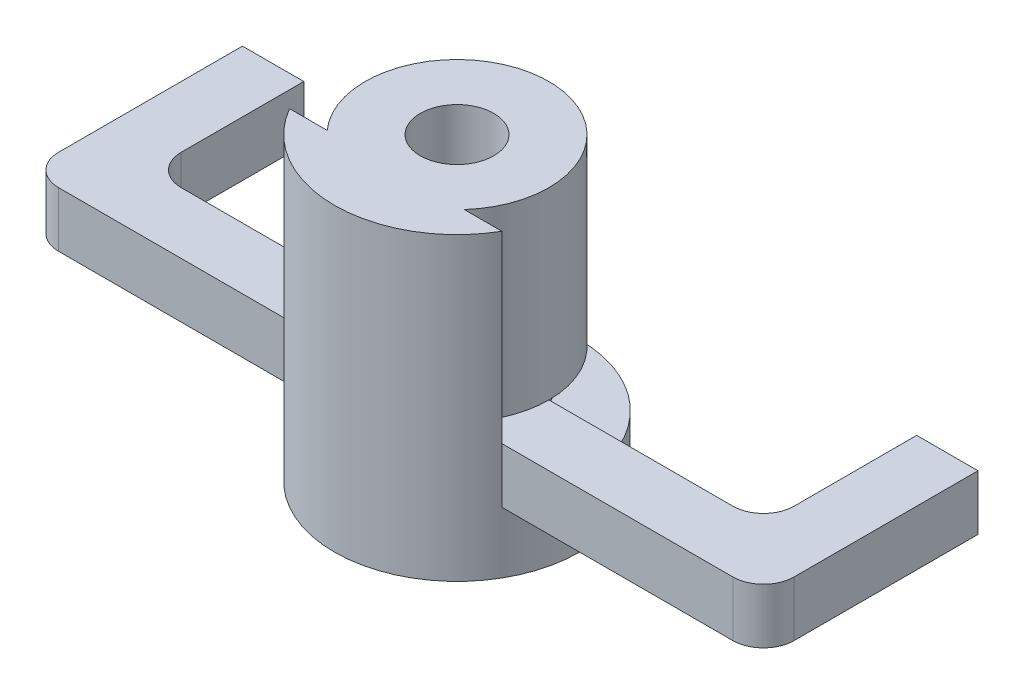
ISO-10303-21;
HEADER;
FILE_DESCRIPTION(('STEP AP214'),'2;1');
FILE_NAME('part.step','',(''),(''),'','','');
FILE_SCHEMA(('AUTOMOTIVE_DESIGN { 1 0 10303 214 1 1 1 1 }'));
ENDSEC;
DATA;
#1=APPLICATION_CONTEXT('core data for automotive mechanical design processes');
#2=APPLICATION_PROTOCOL_DEFINITION('international standard','automotive_design',2000,#1);
#3=PRODUCT_CONTEXT('',#1,'mechanical');
#4=PRODUCT('Part','Part','',(#3));
#5=PRODUCT_RELATED_PRODUCT_CATEGORY('part','',(#4));
#6=PRODUCT_DEFINITION_FORMATION('','',#4);
#7=PRODUCT_DEFINITION_CONTEXT('part definition',#1,'design');
#8=PRODUCT_DEFINITION('design','',#6,#7);
#9=PRODUCT_DEFINITION_SHAPE('','',#8);
#10=(LENGTH_UNIT() NAMED_UNIT(*) SI_UNIT(.MILLI.,.METRE.));
#11=(NAMED_UNIT(*) PLANE_ANGLE_UNIT() SI_UNIT($,.RADIAN.));
#12=(NAMED_UNIT(*) SI_UNIT($,.STERADIAN.) SOLID_ANGLE_UNIT());
#13=UNCERTAINTY_MEASURE_WITH_UNIT(LENGTH_MEASURE(1.E-05),#10,'distance_accuracy_value','');
#14=(GEOMETRIC_REPRESENTATION_CONTEXT(3) GLOBAL_UNCERTAINTY_ASSIGNED_CONTEXT((#13)) GLOBAL_UNIT_ASSIGNED_CONTEXT((#10,
#11,#12)) REPRESENTATION_CONTEXT('',''));
#15=CARTESIAN_POINT('',(0.,0.,0.));
#16=DIRECTION('',(0.,0.,1.));
#17=DIRECTION('',(1.,0.,0.));
#18=AXIS2_PLACEMENT_3D('',#15,#16,#17);
#19=CARTESIAN_POINT('',(0.,1.8,5.));
#20=DIRECTION('',(0.,1.,0.));
#21=DIRECTION('',(0.,0.,1.));
#22=AXIS2_PLACEMENT_3D('',#19,#20,#21);
#23=PLANE('',#22);
#24=DIRECTION('',(1.,0.,0.));
#25=VECTOR('',#24,1.);
#26=CARTESIAN_POINT('',(-12.,1.8,7.));
#27=LINE('',#26,#25);
#28=CARTESIAN_POINT('',(-11.,1.8,7.));
#29=VERTEX_POINT('',#28);
#30=CARTESIAN_POINT('',(-3.46410161513775,1.8,7.));
#31=VERTEX_POINT('',#30);
#32=EDGE_CURVE('E363',#29,#31,#27,.T.);
#33=ORIENTED_EDGE('',*,*,#32,.T.);
#34=DIRECTION('',(-1.,0.,0.));
#35=VECTOR('',#34,1.);
#36=CARTESIAN_POINT('',(-3.46410161513775,1.8,7.));
#37=LINE('',#36,#35);
#38=CARTESIAN_POINT('',(-2.23606797749979,1.8,7.));
#39=VERTEX_POINT('',#38);
#40=EDGE_CURVE('E260',#39,#31,#37,.T.);
#41=ORIENTED_EDGE('',*,*,#40,.F.);
#42=CARTESIAN_POINT('',(0.,1.8,5.));
#43=DIRECTION('',(0.,1.,0.));
#44=DIRECTION('',(0.,0.,1.));
#45=AXIS2_PLACEMENT_3D('',#42,#43,#44);
#46=CIRCLE('',#45,3.);
#47=CARTESIAN_POINT('',(-3.,1.8,5.));
#48=VERTEX_POINT('',#47);
#49=EDGE_CURVE('E289',#48,#39,#46,.T.);
#50=ORIENTED_EDGE('',*,*,#49,.F.);
#51=DIRECTION('',(-1.,0.,0.));
#52=VECTOR('',#51,1.);
#53=CARTESIAN_POINT('',(-2.,1.8,5.));
#54=LINE('',#53,#52);
#55=CARTESIAN_POINT('',(-9.,1.8,5.));
#56=VERTEX_POINT('',#55);
#57=EDGE_CURVE('E388',#48,#56,#54,.T.);
#58=ORIENTED_EDGE('',*,*,#57,.T.);
#59=CARTESIAN_POINT('',(-9.,1.8,4.));
#60=DIRECTION('',(0.,1.,0.));
#61=DIRECTION('',(0.,0.,1.));
#62=AXIS2_PLACEMENT_3D('',#59,#60,#61);
#63=CIRCLE('',#62,1.);
#64=CARTESIAN_POINT('',(-10.,1.8,4.));
#65=VERTEX_POINT('',#64);
#66=EDGE_CURVE('E469',#56,#65,#63,.F.);
#67=ORIENTED_EDGE('',*,*,#66,.T.);
#68=DIRECTION('',(0.,0.,-1.));
#69=VECTOR('',#68,1.);
#70=CARTESIAN_POINT('',(-10.,1.8,0.));
#71=LINE('',#70,#69);
#72=CARTESIAN_POINT('',(-10.,1.8,0.));
#73=VERTEX_POINT('',#72);
#74=EDGE_CURVE('E355',#65,#73,#71,.T.);
#75=ORIENTED_EDGE('',*,*,#74,.T.);
#76=DIRECTION('',(-1.,0.,0.));
#77=VECTOR('',#76,1.);
#78=CARTESIAN_POINT('',(-10.,1.8,0.));
#79=LINE('',#78,#77);
#80=CARTESIAN_POINT('',(-12.,1.8,0.));
#81=VERTEX_POINT('',#80);
#82=EDGE_CURVE('E357',#73,#81,#79,.T.);
#83=ORIENTED_EDGE('',*,*,#82,.T.);
#84=DIRECTION('',(0.,0.,1.));
#85=VECTOR('',#84,1.);
#86=CARTESIAN_POINT('',(-12.,1.8,0.));
#87=LINE('',#86,#85);
#88=CARTESIAN_POINT('',(-12.,1.8,6.));
#89=VERTEX_POINT('',#88);
#90=EDGE_CURVE('E360',#81,#89,#87,.T.);
#91=ORIENTED_EDGE('',*,*,#90,.T.);
#92=CARTESIAN_POINT('',(-11.,1.8,6.));
#93=DIRECTION('',(0.,1.,0.));
#94=DIRECTION('',(0.,0.,1.));
#95=AXIS2_PLACEMENT_3D('',#92,#93,#94);
#96=CIRCLE('',#95,1.);
#97=EDGE_CURVE('E444',#89,#29,#96,.T.);
#98=ORIENTED_EDGE('',*,*,#97,.T.);
#99=EDGE_LOOP('',(#33,#41,#50,#58,#67,#75,#83,#91,#98));
#100=FACE_BOUND('',#99,.T.);
#101=ADVANCED_FACE('F35',(#100),#23,.T.);
#102=CARTESIAN_POINT('',(2.23606797749979,1.8,7.));
#103=VERTEX_POINT('',#102);
#104=CARTESIAN_POINT('',(3.,1.8,5.));
#105=VERTEX_POINT('',#104);
#106=EDGE_CURVE('E288',#103,#105,#46,.T.);
#107=ORIENTED_EDGE('',*,*,#106,.F.);
#108=CARTESIAN_POINT('',(3.46410161513775,1.8,7.));
#109=VERTEX_POINT('',#108);
#110=EDGE_CURVE('E277',#109,#103,#37,.T.);
#111=ORIENTED_EDGE('',*,*,#110,.F.);
#112=DIRECTION('',(1.,0.,0.));
#113=VECTOR('',#112,1.);
#114=CARTESIAN_POINT('',(3.46410161513775,1.8,7.));
#115=LINE('',#114,#113);
#116=CARTESIAN_POINT('',(11.,1.8,7.));
#117=VERTEX_POINT('',#116);
#118=EDGE_CURVE('E366',#109,#117,#115,.T.);
#119=ORIENTED_EDGE('',*,*,#118,.T.);
#120=CARTESIAN_POINT('',(11.,1.8,6.));
#121=DIRECTION('',(0.,1.,0.));
#122=DIRECTION('',(0.,0.,1.));
#123=AXIS2_PLACEMENT_3D('',#120,#121,#122);
#124=CIRCLE('',#123,1.);
#125=CARTESIAN_POINT('',(12.,1.8,6.));
#126=VERTEX_POINT('',#125);
#127=EDGE_CURVE('E442',#117,#126,#124,.T.);
#128=ORIENTED_EDGE('',*,*,#127,.T.);
#129=DIRECTION('',(0.,0.,-1.));
#130=VECTOR('',#129,1.);
#131=CARTESIAN_POINT('',(12.,1.8,7.));
#132=LINE('',#131,#130);
#133=CARTESIAN_POINT('',(12.,1.8,0.));
#134=VERTEX_POINT('',#133);
#135=EDGE_CURVE('E369',#126,#134,#132,.T.);
#136=ORIENTED_EDGE('',*,*,#135,.T.);
#137=DIRECTION('',(-1.,0.,0.));
#138=VECTOR('',#137,1.);
#139=CARTESIAN_POINT('',(12.,1.8,0.));
#140=LINE('',#139,#138);
#141=CARTESIAN_POINT('',(10.,1.8,0.));
#142=VERTEX_POINT('',#141);
#143=EDGE_CURVE('E371',#134,#142,#140,.T.);
#144=ORIENTED_EDGE('',*,*,#143,.T.);
#145=DIRECTION('',(0.,0.,1.));
#146=VECTOR('',#145,1.);
#147=CARTESIAN_POINT('',(10.,1.8,0.));
#148=LINE('',#147,#146);
#149=CARTESIAN_POINT('',(10.,1.8,4.));
#150=VERTEX_POINT('',#149);
#151=EDGE_CURVE('E373',#142,#150,#148,.T.);
#152=ORIENTED_EDGE('',*,*,#151,.T.);
#153=CARTESIAN_POINT('',(9.,1.8,4.));
#154=DIRECTION('',(0.,1.,0.));
#155=DIRECTION('',(0.,0.,1.));
#156=AXIS2_PLACEMENT_3D('',#153,#154,#155);
#157=CIRCLE('',#156,1.);
#158=CARTESIAN_POINT('',(9.,1.8,5.));
#159=VERTEX_POINT('',#158);
#160=EDGE_CURVE('E464',#150,#159,#157,.F.);
#161=ORIENTED_EDGE('',*,*,#160,.T.);
#162=DIRECTION('',(-1.,0.,0.));
#163=VECTOR('',#162,1.);
#164=CARTESIAN_POINT('',(2.,1.8,5.));
#165=LINE('',#164,#163);
#166=EDGE_CURVE('E377',#159,#105,#165,.T.);
#167=ORIENTED_EDGE('',*,*,#166,.T.);
#168=EDGE_LOOP('',(#107,#111,#119,#128,#136,#144,#152,#161,#167));
#169=FACE_BOUND('',#168,.T.);
#170=ADVANCED_FACE('F497',(#169),#23,.T.);
#171=CARTESIAN_POINT('',(0.,7.8,5.));
#172=DIRECTION('',(0.,-1.,0.));
#173=DIRECTION('',(0.,0.,-1.));
#174=AXIS2_PLACEMENT_3D('',#171,#172,#173);
#175=CYLINDRICAL_SURFACE('',#174,3.);
#176=DIRECTION('',(0.,-1.,0.));
#177=VECTOR('',#176,1.);
#178=CARTESIAN_POINT('',(-2.23606797749979,7.8,7.));
#179=LINE('',#178,#177);
#180=CARTESIAN_POINT('',(-2.23606797749979,7.8,7.));
#181=VERTEX_POINT('',#180);
#182=EDGE_CURVE('E11',#181,#39,#179,.T.);
#183=ORIENTED_EDGE('',*,*,#182,.F.);
#184=CARTESIAN_POINT('',(0.,7.8,5.));
#185=DIRECTION('',(0.,1.,0.));
#186=DIRECTION('',(0.,0.,1.));
#187=AXIS2_PLACEMENT_3D('',#184,#185,#186);
#188=CIRCLE('',#187,3.);
#189=CARTESIAN_POINT('',(2.23606797749979,7.8,7.));
#190=VERTEX_POINT('',#189);
#191=EDGE_CURVE('E283',#190,#181,#188,.T.);
#192=ORIENTED_EDGE('',*,*,#191,.F.);
#193=DIRECTION('',(0.,-1.,0.));
#194=VECTOR('',#193,1.);
#195=CARTESIAN_POINT('',(2.23606797749979,7.8,7.));
#196=LINE('',#195,#194);
#197=EDGE_CURVE('E43',#103,#190,#196,.F.);
#198=ORIENTED_EDGE('',*,*,#197,.F.);
#199=ORIENTED_EDGE('',*,*,#106,.T.);
#200=EDGE_CURVE('E281',#105,#48,#46,.T.);
#201=ORIENTED_EDGE('',*,*,#200,.T.);
#202=ORIENTED_EDGE('',*,*,#49,.T.);
#203=EDGE_LOOP('',(#183,#192,#198,#199,#201,#202));
#204=FACE_BOUND('',#203,.T.);
#205=ADVANCED_FACE('F492',(#204),#175,.T.);
#206=CARTESIAN_POINT('',(0.,1.8,5.));
#207=DIRECTION('',(0.,-1.,0.));
#208=DIRECTION('',(0.,0.,-1.));
#209=AXIS2_PLACEMENT_3D('',#206,#207,#208);
#210=CYLINDRICAL_SURFACE('',#209,2.);
#211=CARTESIAN_POINT('',(0.,0.,5.));
#212=DIRECTION('',(0.,-1.,0.));
#213=DIRECTION('',(0.,0.,1.));
#214=AXIS2_PLACEMENT_3D('',#211,#212,#213);
#215=CIRCLE('',#214,2.);
#216=CARTESIAN_POINT('',(0.180277563773204,0.,6.99185842870421));
#217=VERTEX_POINT('',#216);
#218=CARTESIAN_POINT('',(-0.180277563773204,0.,6.99185842870421));
#219=VERTEX_POINT('',#218);
#220=EDGE_CURVE('E415',#217,#219,#215,.T.);
#221=ORIENTED_EDGE('',*,*,#220,.T.);
#222=DIRECTION('',(0.,-1.,0.));
#223=VECTOR('',#222,1.);
#224=CARTESIAN_POINT('',(-0.180277563773204,1.8,6.99185842870421));
#225=LINE('',#224,#223);
#226=CARTESIAN_POINT('',(-0.180277563773204,1.8,6.99185842870421));
#227=VERTEX_POINT('',#226);
#228=EDGE_CURVE('E342',#219,#227,#225,.F.);
#229=ORIENTED_EDGE('',*,*,#228,.T.);
#230=CARTESIAN_POINT('',(0.,1.8,5.));
#231=DIRECTION('',(0.,-1.,0.));
#232=DIRECTION('',(0.,0.,1.));
#233=AXIS2_PLACEMENT_3D('',#230,#231,#232);
#234=CIRCLE('',#233,2.);
#235=CARTESIAN_POINT('',(0.,1.8,7.));
#236=VERTEX_POINT('',#235);
#237=EDGE_CURVE('E50',#236,#227,#234,.T.);
#238=ORIENTED_EDGE('',*,*,#237,.F.);
#239=CARTESIAN_POINT('',(0.180277563773204,1.8,6.99185842870421));
#240=VERTEX_POINT('',#239);
#241=EDGE_CURVE('E520',#240,#236,#234,.T.);
#242=ORIENTED_EDGE('',*,*,#241,.F.);
#243=DIRECTION('',(0.,-1.,0.));
#244=VECTOR('',#243,1.);
#245=CARTESIAN_POINT('',(0.180277563773204,1.8,6.99185842870421));
#246=LINE('',#245,#244);
#247=EDGE_CURVE('E339',#240,#217,#246,.T.);
#248=ORIENTED_EDGE('',*,*,#247,.T.);
#249=EDGE_LOOP('',(#221,#229,#238,#242,#248));
#250=FACE_BOUND('',#249,.T.);
#251=ADVANCED_FACE('F531',(#250),#210,.F.);
#252=CARTESIAN_POINT('',(1.8151387818866,0.,5.83980426439214));
#253=VERTEX_POINT('',#252);
#254=CARTESIAN_POINT('',(1.6348612181134,0.,6.15205416431206));
#255=VERTEX_POINT('',#254);
#256=EDGE_CURVE('E416',#253,#255,#215,.T.);
#257=ORIENTED_EDGE('',*,*,#256,.T.);
#258=DIRECTION('',(0.,-1.,0.));
#259=VECTOR('',#258,1.);
#260=CARTESIAN_POINT('',(1.6348612181134,1.8,6.15205416431206));
#261=LINE('',#260,#259);
#262=CARTESIAN_POINT('',(1.6348612181134,1.8,6.15205416431206));
#263=VERTEX_POINT('',#262);
#264=EDGE_CURVE('E333',#255,#263,#261,.F.);
#265=ORIENTED_EDGE('',*,*,#264,.T.);
#266=CARTESIAN_POINT('',(1.8151387818866,1.8,5.83980426439214));
#267=VERTEX_POINT('',#266);
#268=EDGE_CURVE('E383',#267,#263,#234,.T.);
#269=ORIENTED_EDGE('',*,*,#268,.F.);
#270=DIRECTION('',(0.,-1.,0.));
#271=VECTOR('',#270,1.);
#272=CARTESIAN_POINT('',(1.8151387818866,1.8,5.83980426439214));
#273=LINE('',#272,#271);
#274=EDGE_CURVE('E330',#267,#253,#273,.T.);
#275=ORIENTED_EDGE('',*,*,#274,.T.);
#276=EDGE_LOOP('',(#257,#265,#269,#275));
#277=FACE_BOUND('',#276,.T.);
#278=ADVANCED_FACE('F623',(#277),#210,.F.);
#279=CARTESIAN_POINT('',(0.,0.,5.));
#280=DIRECTION('',(0.,-1.,0.));
#281=DIRECTION('',(0.,0.,-1.));
#282=AXIS2_PLACEMENT_3D('',#279,#280,#281);
#283=PLANE('',#282);
#284=ORIENTED_EDGE('',*,*,#220,.F.);
#285=DIRECTION('',(-1.,0.,0.));
#286=VECTOR('',#285,1.);
#287=CARTESIAN_POINT('',(0.,0.,6.99185842870421));
#288=LINE('',#287,#286);
#289=EDGE_CURVE('E486',#217,#219,#288,.T.);
#290=ORIENTED_EDGE('',*,*,#289,.T.);
#291=EDGE_LOOP('',(#284,#290));
#292=FACE_BOUND('',#291,.T.);
#293=ADVANCED_FACE('F628',(#292),#283,.F.);
#294=ORIENTED_EDGE('',*,*,#256,.F.);
#295=DIRECTION('',(-0.5,0.,0.866025403784439));
#296=VECTOR('',#295,1.);
#297=CARTESIAN_POINT('',(1.725,0.,5.9959292143521));
#298=LINE('',#297,#296);
#299=EDGE_CURVE('E483',#253,#255,#298,.T.);
#300=ORIENTED_EDGE('',*,*,#299,.T.);
#301=EDGE_LOOP('',(#294,#300));
#302=FACE_BOUND('',#301,.T.);
#303=ADVANCED_FACE('F632',(#302),#283,.F.);
#304=DIRECTION('',(1.,0.,0.));
#305=VECTOR('',#304,1.);
#306=CARTESIAN_POINT('',(0.,0.,3.00814157129579));
#307=LINE('',#306,#305);
#308=CARTESIAN_POINT('',(-1.15,0.,3.00814157129579));
#309=VERTEX_POINT('',#308);
#310=CARTESIAN_POINT('',(1.15,0.,3.00814157129579));
#311=VERTEX_POINT('',#310);
#312=EDGE_CURVE('E477',#309,#311,#307,.T.);
#313=ORIENTED_EDGE('',*,*,#312,.T.);
#314=DIRECTION('',(0.5,0.,0.866025403784438));
#315=VECTOR('',#314,1.);
#316=CARTESIAN_POINT('',(1.725,0.,4.00407078564789));
#317=LINE('',#316,#315);
#318=CARTESIAN_POINT('',(2.3,0.,5.));
#319=VERTEX_POINT('',#318);
#320=EDGE_CURVE('E480',#311,#319,#317,.T.);
#321=ORIENTED_EDGE('',*,*,#320,.T.);
#322=DIRECTION('',(-1.,0.,0.));
#323=VECTOR('',#322,1.);
#324=CARTESIAN_POINT('',(2.,0.,5.));
#325=LINE('',#324,#323);
#326=CARTESIAN_POINT('',(4.,0.,5.));
#327=VERTEX_POINT('',#326);
#328=EDGE_CURVE('E408',#327,#319,#325,.T.);
#329=ORIENTED_EDGE('',*,*,#328,.F.);
#330=CARTESIAN_POINT('',(0.,0.,5.));
#331=DIRECTION('',(0.,-1.,0.));
#332=DIRECTION('',(0.,0.,-1.));
#333=AXIS2_PLACEMENT_3D('',#330,#331,#332);
#334=CIRCLE('',#333,4.);
#335=CARTESIAN_POINT('',(-4.,0.,5.));
#336=VERTEX_POINT('',#335);
#337=EDGE_CURVE('E353',#336,#327,#334,.T.);
#338=ORIENTED_EDGE('',*,*,#337,.F.);
#339=DIRECTION('',(-1.,0.,0.));
#340=VECTOR('',#339,1.);
#341=CARTESIAN_POINT('',(-2.,0.,5.));
#342=LINE('',#341,#340);
#343=CARTESIAN_POINT('',(-2.3,0.,5.));
#344=VERTEX_POINT('',#343);
#345=EDGE_CURVE('E358',#344,#336,#342,.T.);
#346=ORIENTED_EDGE('',*,*,#345,.F.);
#347=DIRECTION('',(0.5,0.,-0.866025403784439));
#348=VECTOR('',#347,1.);
#349=CARTESIAN_POINT('',(-1.725,0.,4.0040707856479));
#350=LINE('',#349,#348);
#351=EDGE_CURVE('E474',#344,#309,#350,.T.);
#352=ORIENTED_EDGE('',*,*,#351,.T.);
#353=EDGE_LOOP('',(#313,#321,#329,#338,#346,#352));
#354=FACE_BOUND('',#353,.T.);
#355=ADVANCED_FACE('F570',(#354),#283,.F.);
#356=CARTESIAN_POINT('',(0.,0.,5.));
#357=DIRECTION('',(0.,1.,0.));
#358=DIRECTION('',(0.,0.,1.));
#359=AXIS2_PLACEMENT_3D('',#356,#357,#358);
#360=PLANE('',#359);
#361=CARTESIAN_POINT('',(3.46410161513775,0.,7.));
#362=VERTEX_POINT('',#361);
#363=EDGE_CURVE('E351',#327,#362,#334,.T.);
#364=ORIENTED_EDGE('',*,*,#363,.F.);
#365=CARTESIAN_POINT('',(9.,0.,5.));
#366=VERTEX_POINT('',#365);
#367=EDGE_CURVE('E409',#366,#327,#325,.T.);
#368=ORIENTED_EDGE('',*,*,#367,.F.);
#369=CARTESIAN_POINT('',(9.,0.,4.));
#370=DIRECTION('',(0.,1.,0.));
#371=DIRECTION('',(0.,0.,1.));
#372=AXIS2_PLACEMENT_3D('',#369,#370,#371);
#373=CIRCLE('',#372,1.);
#374=CARTESIAN_POINT('',(10.,0.,4.));
#375=VERTEX_POINT('',#374);
#376=EDGE_CURVE('E462',#366,#375,#373,.T.);
#377=ORIENTED_EDGE('',*,*,#376,.T.);
#378=DIRECTION('',(0.,0.,1.));
#379=VECTOR('',#378,1.);
#380=CARTESIAN_POINT('',(10.,0.,0.));
#381=LINE('',#380,#379);
#382=CARTESIAN_POINT('',(10.,0.,0.));
#383=VERTEX_POINT('',#382);
#384=EDGE_CURVE('E405',#383,#375,#381,.T.);
#385=ORIENTED_EDGE('',*,*,#384,.F.);
#386=DIRECTION('',(-1.,0.,0.));
#387=VECTOR('',#386,1.);
#388=CARTESIAN_POINT('',(12.,0.,0.));
#389=LINE('',#388,#387);
#390=CARTESIAN_POINT('',(12.,0.,0.));
#391=VERTEX_POINT('',#390);
#392=EDGE_CURVE('E403',#391,#383,#389,.T.);
#393=ORIENTED_EDGE('',*,*,#392,.F.);
#394=DIRECTION('',(0.,0.,-1.));
#395=VECTOR('',#394,1.);
#396=CARTESIAN_POINT('',(12.,0.,7.));
#397=LINE('',#396,#395);
#398=CARTESIAN_POINT('',(12.,0.,6.));
#399=VERTEX_POINT('',#398);
#400=EDGE_CURVE('E401',#399,#391,#397,.T.);
#401=ORIENTED_EDGE('',*,*,#400,.F.);
#402=CARTESIAN_POINT('',(11.,0.,6.));
#403=DIRECTION('',(0.,1.,0.));
#404=DIRECTION('',(0.,0.,1.));
#405=AXIS2_PLACEMENT_3D('',#402,#403,#404);
#406=CIRCLE('',#405,1.);
#407=CARTESIAN_POINT('',(11.,0.,7.));
#408=VERTEX_POINT('',#407);
#409=EDGE_CURVE('E436',#399,#408,#406,.F.);
#410=ORIENTED_EDGE('',*,*,#409,.T.);
#411=DIRECTION('',(1.,0.,0.));
#412=VECTOR('',#411,1.);
#413=CARTESIAN_POINT('',(3.46410161513775,0.,7.));
#414=LINE('',#413,#412);
#415=EDGE_CURVE('E398',#362,#408,#414,.T.);
#416=ORIENTED_EDGE('',*,*,#415,.F.);
#417=EDGE_LOOP('',(#364,#368,#377,#385,#393,#401,#410,#416));
#418=FACE_BOUND('',#417,.T.);
#419=ADVANCED_FACE('F573',(#418),#360,.F.);
#420=CARTESIAN_POINT('',(-10.,1.8,0.));
#421=DIRECTION('',(-1.,0.,0.));
#422=DIRECTION('',(0.,0.,1.));
#423=AXIS2_PLACEMENT_3D('',#420,#421,#422);
#424=PLANE('',#423);
#425=ORIENTED_EDGE('',*,*,#74,.F.);
#426=DIRECTION('',(0.,-1.,0.));
#427=VECTOR('',#426,1.);
#428=CARTESIAN_POINT('',(-10.,0.,4.));
#429=LINE('',#428,#427);
#430=CARTESIAN_POINT('',(-10.,0.,4.));
#431=VERTEX_POINT('',#430);
#432=EDGE_CURVE('E456',#65,#431,#429,.T.);
#433=ORIENTED_EDGE('',*,*,#432,.T.);
#434=DIRECTION('',(0.,0.,-1.));
#435=VECTOR('',#434,1.);
#436=CARTESIAN_POINT('',(-10.,0.,0.));
#437=LINE('',#436,#435);
#438=CARTESIAN_POINT('',(-10.,0.,0.));
#439=VERTEX_POINT('',#438);
#440=EDGE_CURVE('E350',#431,#439,#437,.T.);
#441=ORIENTED_EDGE('',*,*,#440,.T.);
#442=DIRECTION('',(0.,-1.,0.));
#443=VECTOR('',#442,1.);
#444=CARTESIAN_POINT('',(-10.,1.8,0.));
#445=LINE('',#444,#443);
#446=EDGE_CURVE('E430',#73,#439,#445,.T.);
#447=ORIENTED_EDGE('',*,*,#446,.F.);
#448=EDGE_LOOP('',(#425,#433,#441,#447));
#449=FACE_BOUND('',#448,.T.);
#450=ADVANCED_FACE('F549',(#449),#424,.F.);
#451=CARTESIAN_POINT('',(-10.,1.8,0.));
#452=DIRECTION('',(0.,0.,1.));
#453=DIRECTION('',(1.,0.,0.));
#454=AXIS2_PLACEMENT_3D('',#451,#452,#453);
#455=PLANE('',#454);
#456=DIRECTION('',(-1.,0.,0.));
#457=VECTOR('',#456,1.);
#458=CARTESIAN_POINT('',(-10.,0.,0.));
#459=LINE('',#458,#457);
#460=CARTESIAN_POINT('',(-12.,0.,0.));
#461=VERTEX_POINT('',#460);
#462=EDGE_CURVE('E390',#439,#461,#459,.T.);
#463=ORIENTED_EDGE('',*,*,#462,.T.);
#464=DIRECTION('',(0.,-1.,0.));
#465=VECTOR('',#464,1.);
#466=CARTESIAN_POINT('',(-12.,1.8,0.));
#467=LINE('',#466,#465);
#468=EDGE_CURVE('E427',#81,#461,#467,.T.);
#469=ORIENTED_EDGE('',*,*,#468,.F.);
#470=ORIENTED_EDGE('',*,*,#82,.F.);
#471=ORIENTED_EDGE('',*,*,#446,.T.);
#472=EDGE_LOOP('',(#463,#469,#470,#471));
#473=FACE_BOUND('',#472,.T.);
#474=ADVANCED_FACE('F551',(#473),#455,.F.);
#475=CARTESIAN_POINT('',(-12.,1.8,0.));
#476=DIRECTION('',(1.,0.,0.));
#477=DIRECTION('',(0.,0.,-1.));
#478=AXIS2_PLACEMENT_3D('',#475,#476,#477);
#479=PLANE('',#478);
#480=DIRECTION('',(0.,0.,1.));
#481=VECTOR('',#480,1.);
#482=CARTESIAN_POINT('',(-12.,0.,0.));
#483=LINE('',#482,#481);
#484=CARTESIAN_POINT('',(-12.,0.,6.));
#485=VERTEX_POINT('',#484);
#486=EDGE_CURVE('E392',#461,#485,#483,.T.);
#487=ORIENTED_EDGE('',*,*,#486,.T.);
#488=DIRECTION('',(0.,-1.,0.));
#489=VECTOR('',#488,1.);
#490=CARTESIAN_POINT('',(-12.,1.8,6.));
#491=LINE('',#490,#489);
#492=EDGE_CURVE('E440',#485,#89,#491,.F.);
#493=ORIENTED_EDGE('',*,*,#492,.T.);
#494=ORIENTED_EDGE('',*,*,#90,.F.);
#495=ORIENTED_EDGE('',*,*,#468,.T.);
#496=EDGE_LOOP('',(#487,#493,#494,#495));
#497=FACE_BOUND('',#496,.T.);
#498=ADVANCED_FACE('F661',(#497),#479,.F.);
#499=CARTESIAN_POINT('',(-12.,1.8,7.));
#500=DIRECTION('',(0.,0.,-1.));
#501=DIRECTION('',(-1.,0.,0.));
#502=AXIS2_PLACEMENT_3D('',#499,#500,#501);
#503=PLANE('',#502);
#504=ORIENTED_EDGE('',*,*,#32,.F.);
#505=DIRECTION('',(0.,-1.,0.));
#506=VECTOR('',#505,1.);
#507=CARTESIAN_POINT('',(-11.,1.8,7.));
#508=LINE('',#507,#506);
#509=CARTESIAN_POINT('',(-11.,0.,7.));
#510=VERTEX_POINT('',#509);
#511=EDGE_CURVE('E433',#29,#510,#508,.T.);
#512=ORIENTED_EDGE('',*,*,#511,.T.);
#513=DIRECTION('',(1.,0.,0.));
#514=VECTOR('',#513,1.);
#515=CARTESIAN_POINT('',(-12.,0.,7.));
#516=LINE('',#515,#514);
#517=CARTESIAN_POINT('',(-3.46410161513775,0.,7.));
#518=VERTEX_POINT('',#517);
#519=EDGE_CURVE('E395',#510,#518,#516,.T.);
#520=ORIENTED_EDGE('',*,*,#519,.T.);
#521=DIRECTION('',(0.,-1.,0.));
#522=VECTOR('',#521,1.);
#523=CARTESIAN_POINT('',(-3.46410161513775,1.8,7.));
#524=LINE('',#523,#522);
#525=EDGE_CURVE('E425',#31,#518,#524,.T.);
#526=ORIENTED_EDGE('',*,*,#525,.F.);
#527=EDGE_LOOP('',(#504,#512,#520,#526));
#528=FACE_BOUND('',#527,.T.);
#529=ADVANCED_FACE('F563',(#528),#503,.F.);
#530=CARTESIAN_POINT('',(0.,1.8,5.));
#531=DIRECTION('',(0.,-1.,0.));
#532=DIRECTION('',(0.,0.,-1.));
#533=AXIS2_PLACEMENT_3D('',#530,#531,#532);
#534=CYLINDRICAL_SURFACE('',#533,4.);
#535=ORIENTED_EDGE('',*,*,#525,.T.);
#536=EDGE_CURVE('E354',#518,#336,#334,.T.);
#537=ORIENTED_EDGE('',*,*,#536,.T.);
#538=ORIENTED_EDGE('',*,*,#337,.T.);
#539=ORIENTED_EDGE('',*,*,#363,.T.);
#540=DIRECTION('',(0.,-1.,0.));
#541=VECTOR('',#540,1.);
#542=CARTESIAN_POINT('',(3.46410161513775,1.8,7.));
#543=LINE('',#542,#541);
#544=EDGE_CURVE('E256',#109,#362,#543,.T.);
#545=ORIENTED_EDGE('',*,*,#544,.F.);
#546=DIRECTION('',(0.,-1.,0.));
#547=VECTOR('',#546,1.);
#548=CARTESIAN_POINT('',(3.46410161513775,15.011102550928,7.));
#549=LINE('',#548,#547);
#550=CARTESIAN_POINT('',(3.46410161513775,7.8,7.));
#551=VERTEX_POINT('',#550);
#552=EDGE_CURVE('E249',#551,#109,#549,.T.);
#553=ORIENTED_EDGE('',*,*,#552,.F.);
#554=CARTESIAN_POINT('',(0.,7.8,5.));
#555=DIRECTION('',(0.,1.,0.));
#556=DIRECTION('',(0.,0.,1.));
#557=AXIS2_PLACEMENT_3D('',#554,#555,#556);
#558=CIRCLE('',#557,4.);
#559=CARTESIAN_POINT('',(-3.46410161513775,7.8,7.));
#560=VERTEX_POINT('',#559);
#561=EDGE_CURVE('E254',#560,#551,#558,.T.);
#562=ORIENTED_EDGE('',*,*,#561,.F.);
#563=DIRECTION('',(0.,-1.,0.));
#564=VECTOR('',#563,1.);
#565=CARTESIAN_POINT('',(-3.46410161513775,15.011102550928,7.));
#566=LINE('',#565,#564);
#567=EDGE_CURVE('E261',#560,#31,#566,.T.);
#568=ORIENTED_EDGE('',*,*,#567,.T.);
#569=EDGE_LOOP('',(#535,#537,#538,#539,#545,#553,#562,#568));
#570=FACE_BOUND('',#569,.T.);
#571=CARTESIAN_POINT('',(0.,-2.,5.));
#572=DIRECTION('',(0.,-1.,0.));
#573=DIRECTION('',(0.,0.,-1.));
#574=AXIS2_PLACEMENT_3D('',#571,#572,#573);
#575=CIRCLE('',#574,4.);
#576=CARTESIAN_POINT('',(0.,-2.,0.999999999999999));
#577=VERTEX_POINT('',#576);
#578=EDGE_CURVE('E347',#577,#577,#575,.T.);
#579=ORIENTED_EDGE('',*,*,#578,.F.);
#580=EDGE_LOOP('',(#579));
#581=FACE_BOUND('',#580,.T.);
#582=ADVANCED_FACE('F251',(#570,#581),#534,.T.);
#583=CARTESIAN_POINT('',(3.46410161513775,1.8,7.));
#584=DIRECTION('',(0.,0.,-1.));
#585=DIRECTION('',(-1.,0.,0.));
#586=AXIS2_PLACEMENT_3D('',#583,#584,#585);
#587=PLANE('',#586);
#588=ORIENTED_EDGE('',*,*,#415,.T.);
#589=DIRECTION('',(0.,-1.,0.));
#590=VECTOR('',#589,1.);
#591=CARTESIAN_POINT('',(11.,1.8,7.));
#592=LINE('',#591,#590);
#593=EDGE_CURVE('E449',#408,#117,#592,.F.);
#594=ORIENTED_EDGE('',*,*,#593,.T.);
#595=ORIENTED_EDGE('',*,*,#118,.F.);
#596=ORIENTED_EDGE('',*,*,#544,.T.);
#597=EDGE_LOOP('',(#588,#594,#595,#596));
#598=FACE_BOUND('',#597,.T.);
#599=ADVANCED_FACE('F579',(#598),#587,.F.);
#600=CARTESIAN_POINT('',(12.,1.8,7.));
#601=DIRECTION('',(-1.,0.,0.));
#602=DIRECTION('',(0.,0.,1.));
#603=AXIS2_PLACEMENT_3D('',#600,#601,#602);
#604=PLANE('',#603);
#605=ORIENTED_EDGE('',*,*,#135,.F.);
#606=DIRECTION('',(0.,-1.,0.));
#607=VECTOR('',#606,1.);
#608=CARTESIAN_POINT('',(12.,1.8,6.));
#609=LINE('',#608,#607);
#610=EDGE_CURVE('E446',#126,#399,#609,.T.);
#611=ORIENTED_EDGE('',*,*,#610,.T.);
#612=ORIENTED_EDGE('',*,*,#400,.T.);
#613=DIRECTION('',(0.,-1.,0.));
#614=VECTOR('',#613,1.);
#615=CARTESIAN_POINT('',(12.,1.8,0.));
#616=LINE('',#615,#614);
#617=EDGE_CURVE('E421',#134,#391,#616,.T.);
#618=ORIENTED_EDGE('',*,*,#617,.F.);
#619=EDGE_LOOP('',(#605,#611,#612,#618));
#620=FACE_BOUND('',#619,.T.);
#621=ADVANCED_FACE('F587',(#620),#604,.F.);
#622=CARTESIAN_POINT('',(12.,1.8,0.));
#623=DIRECTION('',(0.,0.,1.));
#624=DIRECTION('',(1.,0.,0.));
#625=AXIS2_PLACEMENT_3D('',#622,#623,#624);
#626=PLANE('',#625);
#627=ORIENTED_EDGE('',*,*,#392,.T.);
#628=DIRECTION('',(0.,-1.,0.));
#629=VECTOR('',#628,1.);
#630=CARTESIAN_POINT('',(10.,1.8,0.));
#631=LINE('',#630,#629);
#632=EDGE_CURVE('E387',#142,#383,#631,.T.);
#633=ORIENTED_EDGE('',*,*,#632,.F.);
#634=ORIENTED_EDGE('',*,*,#143,.F.);
#635=ORIENTED_EDGE('',*,*,#617,.T.);
#636=EDGE_LOOP('',(#627,#633,#634,#635));
#637=FACE_BOUND('',#636,.T.);
#638=ADVANCED_FACE('F592',(#637),#626,.F.);
#639=CARTESIAN_POINT('',(10.,1.8,0.));
#640=DIRECTION('',(1.,0.,0.));
#641=DIRECTION('',(0.,0.,-1.));
#642=AXIS2_PLACEMENT_3D('',#639,#640,#641);
#643=PLANE('',#642);
#644=ORIENTED_EDGE('',*,*,#384,.T.);
#645=DIRECTION('',(0.,-1.,0.));
#646=VECTOR('',#645,1.);
#647=CARTESIAN_POINT('',(10.,1.8,4.));
#648=LINE('',#647,#646);
#649=EDGE_CURVE('E454',#375,#150,#648,.F.);
#650=ORIENTED_EDGE('',*,*,#649,.T.);
#651=ORIENTED_EDGE('',*,*,#151,.F.);
#652=ORIENTED_EDGE('',*,*,#632,.T.);
#653=EDGE_LOOP('',(#644,#650,#651,#652));
#654=FACE_BOUND('',#653,.T.);
#655=ADVANCED_FACE('F598',(#654),#643,.F.);
#656=CARTESIAN_POINT('',(2.,1.8,5.));
#657=DIRECTION('',(0.,0.,1.));
#658=DIRECTION('',(1.,0.,0.));
#659=AXIS2_PLACEMENT_3D('',#656,#657,#658);
#660=PLANE('',#659);
#661=ORIENTED_EDGE('',*,*,#328,.T.);
#662=DIRECTION('',(0.,-1.,0.));
#663=VECTOR('',#662,1.);
#664=CARTESIAN_POINT('',(2.3,9.,5.));
#665=LINE('',#664,#663);
#666=CARTESIAN_POINT('',(2.3,1.8,5.));
#667=VERTEX_POINT('',#666);
#668=EDGE_CURVE('E310',#667,#319,#665,.T.);
#669=ORIENTED_EDGE('',*,*,#668,.F.);
#670=EDGE_CURVE('E376',#105,#667,#165,.T.);
#671=ORIENTED_EDGE('',*,*,#670,.F.);
#672=ORIENTED_EDGE('',*,*,#166,.F.);
#673=DIRECTION('',(0.,-1.,0.));
#674=VECTOR('',#673,1.);
#675=CARTESIAN_POINT('',(9.,0.,5.));
#676=LINE('',#675,#674);
#677=EDGE_CURVE('E451',#159,#366,#676,.T.);
#678=ORIENTED_EDGE('',*,*,#677,.T.);
#679=ORIENTED_EDGE('',*,*,#367,.T.);
#680=EDGE_LOOP('',(#661,#669,#671,#672,#678,#679));
#681=FACE_BOUND('',#680,.T.);
#682=ADVANCED_FACE('F504',(#681),#660,.F.);
#683=CARTESIAN_POINT('',(-1.63486121811339,0.,6.15205416431208));
#684=VERTEX_POINT('',#683);
#685=CARTESIAN_POINT('',(-1.81513878188661,0.,5.83980426439213));
#686=VERTEX_POINT('',#685);
#687=EDGE_CURVE('E412',#684,#686,#215,.T.);
#688=ORIENTED_EDGE('',*,*,#687,.T.);
#689=DIRECTION('',(0.,-1.,0.));
#690=VECTOR('',#689,1.);
#691=CARTESIAN_POINT('',(-1.81513878188661,1.8,5.83980426439213));
#692=LINE('',#691,#690);
#693=CARTESIAN_POINT('',(-1.81513878188661,1.8,5.83980426439213));
#694=VERTEX_POINT('',#693);
#695=EDGE_CURVE('E324',#686,#694,#692,.F.);
#696=ORIENTED_EDGE('',*,*,#695,.T.);
#697=CARTESIAN_POINT('',(-1.63486121811339,1.8,6.15205416431208));
#698=VERTEX_POINT('',#697);
#699=EDGE_CURVE('E380',#698,#694,#234,.T.);
#700=ORIENTED_EDGE('',*,*,#699,.F.);
#701=DIRECTION('',(0.,-1.,0.));
#702=VECTOR('',#701,1.);
#703=CARTESIAN_POINT('',(-1.63486121811339,1.8,6.15205416431208));
#704=LINE('',#703,#702);
#705=EDGE_CURVE('E309',#698,#684,#704,.T.);
#706=ORIENTED_EDGE('',*,*,#705,.T.);
#707=EDGE_LOOP('',(#688,#696,#700,#706));
#708=FACE_BOUND('',#707,.T.);
#709=ADVANCED_FACE('F605',(#708),#210,.F.);
#710=CARTESIAN_POINT('',(-2.,1.8,5.));
#711=DIRECTION('',(0.,0.,1.));
#712=DIRECTION('',(1.,0.,0.));
#713=AXIS2_PLACEMENT_3D('',#710,#711,#712);
#714=PLANE('',#713);
#715=CARTESIAN_POINT('',(-2.3,1.8,5.));
#716=VERTEX_POINT('',#715);
#717=EDGE_CURVE('E384',#716,#48,#54,.T.);
#718=ORIENTED_EDGE('',*,*,#717,.F.);
#719=DIRECTION('',(0.,-1.,0.));
#720=VECTOR('',#719,1.);
#721=CARTESIAN_POINT('',(-2.3,9.,5.));
#722=LINE('',#721,#720);
#723=EDGE_CURVE('E317',#716,#344,#722,.T.);
#724=ORIENTED_EDGE('',*,*,#723,.T.);
#725=ORIENTED_EDGE('',*,*,#345,.T.);
#726=CARTESIAN_POINT('',(-9.,0.,5.));
#727=VERTEX_POINT('',#726);
#728=EDGE_CURVE('E418',#336,#727,#342,.T.);
#729=ORIENTED_EDGE('',*,*,#728,.T.);
#730=DIRECTION('',(0.,-1.,0.));
#731=VECTOR('',#730,1.);
#732=CARTESIAN_POINT('',(-9.,1.8,5.));
#733=LINE('',#732,#731);
#734=EDGE_CURVE('E459',#727,#56,#733,.F.);
#735=ORIENTED_EDGE('',*,*,#734,.T.);
#736=ORIENTED_EDGE('',*,*,#57,.F.);
#737=EDGE_LOOP('',(#718,#724,#725,#729,#735,#736));
#738=FACE_BOUND('',#737,.T.);
#739=ADVANCED_FACE('F514',(#738),#714,.F.);
#740=ORIENTED_EDGE('',*,*,#536,.F.);
#741=ORIENTED_EDGE('',*,*,#519,.F.);
#742=CARTESIAN_POINT('',(-11.,0.,6.));
#743=DIRECTION('',(0.,1.,0.));
#744=DIRECTION('',(0.,0.,1.));
#745=AXIS2_PLACEMENT_3D('',#742,#743,#744);
#746=CIRCLE('',#745,1.);
#747=EDGE_CURVE('E438',#510,#485,#746,.F.);
#748=ORIENTED_EDGE('',*,*,#747,.T.);
#749=ORIENTED_EDGE('',*,*,#486,.F.);
#750=ORIENTED_EDGE('',*,*,#462,.F.);
#751=ORIENTED_EDGE('',*,*,#440,.F.);
#752=CARTESIAN_POINT('',(-9.,0.,4.));
#753=DIRECTION('',(0.,1.,0.));
#754=DIRECTION('',(0.,0.,1.));
#755=AXIS2_PLACEMENT_3D('',#752,#753,#754);
#756=CIRCLE('',#755,1.);
#757=EDGE_CURVE('E466',#431,#727,#756,.T.);
#758=ORIENTED_EDGE('',*,*,#757,.T.);
#759=ORIENTED_EDGE('',*,*,#728,.F.);
#760=EDGE_LOOP('',(#740,#741,#748,#749,#750,#751,#758,#759));
#761=FACE_BOUND('',#760,.T.);
#762=ADVANCED_FACE('F541',(#761),#360,.F.);
#763=CARTESIAN_POINT('',(-11.,1.8,6.));
#764=DIRECTION('',(0.,-1.,0.));
#765=DIRECTION('',(0.,0.,-1.));
#766=AXIS2_PLACEMENT_3D('',#763,#764,#765);
#767=CYLINDRICAL_SURFACE('',#766,1.);
#768=ORIENTED_EDGE('',*,*,#97,.F.);
#769=ORIENTED_EDGE('',*,*,#492,.F.);
#770=ORIENTED_EDGE('',*,*,#747,.F.);
#771=ORIENTED_EDGE('',*,*,#511,.F.);
#772=EDGE_LOOP('',(#768,#769,#770,#771));
#773=FACE_BOUND('',#772,.T.);
#774=ADVANCED_FACE('F560',(#773),#767,.T.);
#775=CARTESIAN_POINT('',(11.,1.8,6.));
#776=DIRECTION('',(0.,-1.,0.));
#777=DIRECTION('',(0.,0.,-1.));
#778=AXIS2_PLACEMENT_3D('',#775,#776,#777);
#779=CYLINDRICAL_SURFACE('',#778,1.);
#780=ORIENTED_EDGE('',*,*,#127,.F.);
#781=ORIENTED_EDGE('',*,*,#593,.F.);
#782=ORIENTED_EDGE('',*,*,#409,.F.);
#783=ORIENTED_EDGE('',*,*,#610,.F.);
#784=EDGE_LOOP('',(#780,#781,#782,#783));
#785=FACE_BOUND('',#784,.T.);
#786=ADVANCED_FACE('F582',(#785),#779,.T.);
#787=CARTESIAN_POINT('',(9.,1.8,4.));
#788=DIRECTION('',(0.,1.,0.));
#789=DIRECTION('',(0.,0.,1.));
#790=AXIS2_PLACEMENT_3D('',#787,#788,#789);
#791=CYLINDRICAL_SURFACE('',#790,1.);
#792=ORIENTED_EDGE('',*,*,#160,.F.);
#793=ORIENTED_EDGE('',*,*,#649,.F.);
#794=ORIENTED_EDGE('',*,*,#376,.F.);
#795=ORIENTED_EDGE('',*,*,#677,.F.);
#796=EDGE_LOOP('',(#792,#793,#794,#795));
#797=FACE_BOUND('',#796,.T.);
#798=ADVANCED_FACE('F597',(#797),#791,.F.);
#799=CARTESIAN_POINT('',(-9.,1.8,4.));
#800=DIRECTION('',(0.,1.,0.));
#801=DIRECTION('',(0.,0.,1.));
#802=AXIS2_PLACEMENT_3D('',#799,#800,#801);
#803=CYLINDRICAL_SURFACE('',#802,1.);
#804=ORIENTED_EDGE('',*,*,#66,.F.);
#805=ORIENTED_EDGE('',*,*,#734,.F.);
#806=ORIENTED_EDGE('',*,*,#757,.F.);
#807=ORIENTED_EDGE('',*,*,#432,.F.);
#808=EDGE_LOOP('',(#804,#805,#806,#807));
#809=FACE_BOUND('',#808,.T.);
#810=ADVANCED_FACE('F37',(#809),#803,.F.);
#811=CARTESIAN_POINT('',(0.,-2.,5.));
#812=DIRECTION('',(0.,-1.,0.));
#813=DIRECTION('',(0.,0.,-1.));
#814=AXIS2_PLACEMENT_3D('',#811,#812,#813);
#815=PLANE('',#814);
#816=DIRECTION('',(-1.,0.,0.));
#817=VECTOR('',#816,1.);
#818=CARTESIAN_POINT('',(1.15,-2.,6.99185842870421));
#819=LINE('',#818,#817);
#820=CARTESIAN_POINT('',(1.15,-2.,6.99185842870421));
#821=VERTEX_POINT('',#820);
#822=CARTESIAN_POINT('',(-1.15,-2.,6.99185842870421));
#823=VERTEX_POINT('',#822);
#824=EDGE_CURVE('E285',#821,#823,#819,.T.);
#825=ORIENTED_EDGE('',*,*,#824,.F.);
#826=DIRECTION('',(-0.5,0.,0.866025403784439));
#827=VECTOR('',#826,1.);
#828=CARTESIAN_POINT('',(2.3,-2.,5.));
#829=LINE('',#828,#827);
#830=CARTESIAN_POINT('',(2.3,-2.,5.));
#831=VERTEX_POINT('',#830);
#832=EDGE_CURVE('E303',#831,#821,#829,.T.);
#833=ORIENTED_EDGE('',*,*,#832,.F.);
#834=DIRECTION('',(0.5,0.,0.866025403784438));
#835=VECTOR('',#834,1.);
#836=CARTESIAN_POINT('',(1.15,-2.,3.00814157129579));
#837=LINE('',#836,#835);
#838=CARTESIAN_POINT('',(1.15,-2.,3.00814157129579));
#839=VERTEX_POINT('',#838);
#840=EDGE_CURVE('E300',#839,#831,#837,.T.);
#841=ORIENTED_EDGE('',*,*,#840,.F.);
#842=DIRECTION('',(1.,0.,0.));
#843=VECTOR('',#842,1.);
#844=CARTESIAN_POINT('',(-1.15,-2.,3.00814157129579));
#845=LINE('',#844,#843);
#846=CARTESIAN_POINT('',(-1.15,-2.,3.00814157129579));
#847=VERTEX_POINT('',#846);
#848=EDGE_CURVE('E297',#847,#839,#845,.T.);
#849=ORIENTED_EDGE('',*,*,#848,.F.);
#850=DIRECTION('',(0.5,0.,-0.866025403784439));
#851=VECTOR('',#850,1.);
#852=CARTESIAN_POINT('',(-2.3,-2.,5.));
#853=LINE('',#852,#851);
#854=CARTESIAN_POINT('',(-2.3,-2.,5.));
#855=VERTEX_POINT('',#854);
#856=EDGE_CURVE('E294',#855,#847,#853,.T.);
#857=ORIENTED_EDGE('',*,*,#856,.F.);
#858=DIRECTION('',(-0.5,0.,-0.866025403784439));
#859=VECTOR('',#858,1.);
#860=CARTESIAN_POINT('',(-1.15,-2.,6.99185842870421));
#861=LINE('',#860,#859);
#862=EDGE_CURVE('E291',#823,#855,#861,.T.);
#863=ORIENTED_EDGE('',*,*,#862,.F.);
#864=EDGE_LOOP('',(#825,#833,#841,#849,#857,#863));
#865=FACE_BOUND('',#864,.T.);
#866=ORIENTED_EDGE('',*,*,#578,.T.);
#867=EDGE_LOOP('',(#866));
#868=FACE_BOUND('',#867,.T.);
#869=ADVANCED_FACE('F639',(#865,#868),#815,.T.);
#870=ORIENTED_EDGE('',*,*,#687,.F.);
#871=DIRECTION('',(-0.5,0.,-0.866025403784439));
#872=VECTOR('',#871,1.);
#873=CARTESIAN_POINT('',(-1.725,0.,5.9959292143521));
#874=LINE('',#873,#872);
#875=EDGE_CURVE('E471',#684,#686,#874,.T.);
#876=ORIENTED_EDGE('',*,*,#875,.T.);
#877=EDGE_LOOP('',(#870,#876));
#878=FACE_BOUND('',#877,.T.);
#879=ADVANCED_FACE('F615',(#878),#283,.F.);
#880=CARTESIAN_POINT('',(1.15,9.,3.00814157129579));
#881=DIRECTION('',(0.866025403784438,0.,-0.5));
#882=DIRECTION('',(-0.5,0.,-0.866025403784438));
#883=AXIS2_PLACEMENT_3D('',#880,#881,#882);
#884=PLANE('',#883);
#885=DIRECTION('',(0.,-1.,0.));
#886=VECTOR('',#885,1.);
#887=CARTESIAN_POINT('',(1.15,9.,3.00814157129579));
#888=LINE('',#887,#886);
#889=EDGE_CURVE('E313',#311,#839,#888,.T.);
#890=ORIENTED_EDGE('',*,*,#889,.T.);
#891=ORIENTED_EDGE('',*,*,#840,.T.);
#892=EDGE_CURVE('E311',#319,#831,#665,.T.);
#893=ORIENTED_EDGE('',*,*,#892,.F.);
#894=ORIENTED_EDGE('',*,*,#320,.F.);
#895=EDGE_LOOP('',(#890,#891,#893,#894));
#896=FACE_BOUND('',#895,.T.);
#897=ADVANCED_FACE('F638',(#896),#884,.F.);
#898=CARTESIAN_POINT('',(-1.15,9.,3.00814157129579));
#899=DIRECTION('',(0.,0.,-1.));
#900=DIRECTION('',(-1.,0.,0.));
#901=AXIS2_PLACEMENT_3D('',#898,#899,#900);
#902=PLANE('',#901);
#903=DIRECTION('',(0.,-1.,0.));
#904=VECTOR('',#903,1.);
#905=CARTESIAN_POINT('',(-1.15,9.,3.00814157129579));
#906=LINE('',#905,#904);
#907=EDGE_CURVE('E315',#309,#847,#906,.T.);
#908=ORIENTED_EDGE('',*,*,#907,.T.);
#909=ORIENTED_EDGE('',*,*,#848,.T.);
#910=ORIENTED_EDGE('',*,*,#889,.F.);
#911=ORIENTED_EDGE('',*,*,#312,.F.);
#912=EDGE_LOOP('',(#908,#909,#910,#911));
#913=FACE_BOUND('',#912,.T.);
#914=ADVANCED_FACE('F645',(#913),#902,.F.);
#915=CARTESIAN_POINT('',(-2.3,9.,5.));
#916=DIRECTION('',(-0.866025403784439,0.,-0.5));
#917=DIRECTION('',(-0.5,0.,0.866025403784439));
#918=AXIS2_PLACEMENT_3D('',#915,#916,#917);
#919=PLANE('',#918);
#920=EDGE_CURVE('E318',#344,#855,#722,.T.);
#921=ORIENTED_EDGE('',*,*,#920,.T.);
#922=ORIENTED_EDGE('',*,*,#856,.T.);
#923=ORIENTED_EDGE('',*,*,#907,.F.);
#924=ORIENTED_EDGE('',*,*,#351,.F.);
#925=EDGE_LOOP('',(#921,#922,#923,#924));
#926=FACE_BOUND('',#925,.T.);
#927=ADVANCED_FACE('F702',(#926),#919,.F.);
#928=CARTESIAN_POINT('',(1.15,9.,6.99185842870421));
#929=DIRECTION('',(0.,0.,1.));
#930=DIRECTION('',(1.,0.,0.));
#931=AXIS2_PLACEMENT_3D('',#928,#929,#930);
#932=PLANE('',#931);
#933=DIRECTION('',(1.,0.,0.));
#934=VECTOR('',#933,1.);
#935=CARTESIAN_POINT('',(0.,1.8,6.99185842870421));
#936=LINE('',#935,#934);
#937=CARTESIAN_POINT('',(-1.15,1.8,6.99185842870421));
#938=VERTEX_POINT('',#937);
#939=EDGE_CURVE('E346',#938,#227,#936,.T.);
#940=ORIENTED_EDGE('',*,*,#939,.T.);
#941=ORIENTED_EDGE('',*,*,#228,.F.);
#942=ORIENTED_EDGE('',*,*,#289,.F.);
#943=ORIENTED_EDGE('',*,*,#247,.F.);
#944=CARTESIAN_POINT('',(1.15,1.8,6.99185842870421));
#945=VERTEX_POINT('',#944);
#946=EDGE_CURVE('E344',#240,#945,#936,.T.);
#947=ORIENTED_EDGE('',*,*,#946,.T.);
#948=DIRECTION('',(0.,-1.,0.));
#949=VECTOR('',#948,1.);
#950=CARTESIAN_POINT('',(1.15,9.,6.99185842870421));
#951=LINE('',#950,#949);
#952=EDGE_CURVE('E307',#945,#821,#951,.T.);
#953=ORIENTED_EDGE('',*,*,#952,.T.);
#954=ORIENTED_EDGE('',*,*,#824,.T.);
#955=DIRECTION('',(0.,-1.,0.));
#956=VECTOR('',#955,1.);
#957=CARTESIAN_POINT('',(-1.15,9.,6.99185842870421));
#958=LINE('',#957,#956);
#959=EDGE_CURVE('E306',#938,#823,#958,.T.);
#960=ORIENTED_EDGE('',*,*,#959,.F.);
#961=EDGE_LOOP('',(#940,#941,#942,#943,#947,#953,#954,#960));
#962=FACE_BOUND('',#961,.T.);
#963=ADVANCED_FACE('F529',(#962),#932,.F.);
#964=CARTESIAN_POINT('',(2.3,9.,5.));
#965=DIRECTION('',(0.866025403784439,0.,0.5));
#966=DIRECTION('',(0.5,0.,-0.866025403784439));
#967=AXIS2_PLACEMENT_3D('',#964,#965,#966);
#968=PLANE('',#967);
#969=DIRECTION('',(0.5,0.,-0.866025403784439));
#970=VECTOR('',#969,1.);
#971=CARTESIAN_POINT('',(1.725,1.8,5.9959292143521));
#972=LINE('',#971,#970);
#973=EDGE_CURVE('E338',#945,#263,#972,.T.);
#974=ORIENTED_EDGE('',*,*,#973,.T.);
#975=ORIENTED_EDGE('',*,*,#264,.F.);
#976=ORIENTED_EDGE('',*,*,#299,.F.);
#977=ORIENTED_EDGE('',*,*,#274,.F.);
#978=EDGE_CURVE('E336',#267,#667,#972,.T.);
#979=ORIENTED_EDGE('',*,*,#978,.T.);
#980=ORIENTED_EDGE('',*,*,#668,.T.);
#981=ORIENTED_EDGE('',*,*,#892,.T.);
#982=ORIENTED_EDGE('',*,*,#832,.T.);
#983=ORIENTED_EDGE('',*,*,#952,.F.);
#984=EDGE_LOOP('',(#974,#975,#976,#977,#979,#980,#981,#982,#983));
#985=FACE_BOUND('',#984,.T.);
#986=ADVANCED_FACE('F744',(#985),#968,.F.);
#987=CARTESIAN_POINT('',(-1.15,9.,6.99185842870421));
#988=DIRECTION('',(-0.866025403784439,0.,0.5));
#989=DIRECTION('',(0.5,0.,0.866025403784439));
#990=AXIS2_PLACEMENT_3D('',#987,#988,#989);
#991=PLANE('',#990);
#992=DIRECTION('',(0.5,0.,0.866025403784439));
#993=VECTOR('',#992,1.);
#994=CARTESIAN_POINT('',(-1.725,1.8,5.9959292143521));
#995=LINE('',#994,#993);
#996=EDGE_CURVE('E329',#716,#694,#995,.T.);
#997=ORIENTED_EDGE('',*,*,#996,.T.);
#998=ORIENTED_EDGE('',*,*,#695,.F.);
#999=ORIENTED_EDGE('',*,*,#875,.F.);
#1000=ORIENTED_EDGE('',*,*,#705,.F.);
#1001=EDGE_CURVE('E327',#698,#938,#995,.T.);
#1002=ORIENTED_EDGE('',*,*,#1001,.T.);
#1003=ORIENTED_EDGE('',*,*,#959,.T.);
#1004=ORIENTED_EDGE('',*,*,#862,.T.);
#1005=ORIENTED_EDGE('',*,*,#920,.F.);
#1006=ORIENTED_EDGE('',*,*,#723,.F.);
#1007=EDGE_LOOP('',(#997,#998,#999,#1000,#1002,#1003,#1004,#1005,#1006));
#1008=FACE_BOUND('',#1007,.T.);
#1009=ADVANCED_FACE('F753',(#1008),#991,.F.);
#1010=CARTESIAN_POINT('',(0.,1.8,5.));
#1011=DIRECTION('',(0.,1.,0.));
#1012=DIRECTION('',(0.,0.,1.));
#1013=AXIS2_PLACEMENT_3D('',#1010,#1011,#1012);
#1014=PLANE('',#1013);
#1015=CARTESIAN_POINT('',(0.,1.8,5.));
#1016=DIRECTION('',(0.,1.,0.));
#1017=DIRECTION('',(0.,0.,1.));
#1018=AXIS2_PLACEMENT_3D('',#1015,#1016,#1017);
#1019=CIRCLE('',#1018,1.2);
#1020=CARTESIAN_POINT('',(0.,1.8,6.2));
#1021=VERTEX_POINT('',#1020);
#1022=EDGE_CURVE('E271',#1021,#1021,#1019,.T.);
#1023=ORIENTED_EDGE('',*,*,#1022,.T.);
#1024=EDGE_LOOP('',(#1023));
#1025=FACE_BOUND('',#1024,.T.);
#1026=ORIENTED_EDGE('',*,*,#996,.F.);
#1027=ORIENTED_EDGE('',*,*,#717,.T.);
#1028=ORIENTED_EDGE('',*,*,#200,.F.);
#1029=ORIENTED_EDGE('',*,*,#670,.T.);
#1030=ORIENTED_EDGE('',*,*,#978,.F.);
#1031=ORIENTED_EDGE('',*,*,#268,.T.);
#1032=ORIENTED_EDGE('',*,*,#973,.F.);
#1033=ORIENTED_EDGE('',*,*,#946,.F.);
#1034=ORIENTED_EDGE('',*,*,#241,.T.);
#1035=ORIENTED_EDGE('',*,*,#237,.T.);
#1036=ORIENTED_EDGE('',*,*,#939,.F.);
#1037=ORIENTED_EDGE('',*,*,#1001,.F.);
#1038=ORIENTED_EDGE('',*,*,#699,.T.);
#1039=EDGE_LOOP('',(#1026,#1027,#1028,#1029,#1030,#1031,#1032,#1033,#1034,#1035,#1036,#1037,#1038));
#1040=FACE_BOUND('',#1039,.T.);
#1041=ADVANCED_FACE('F509',(#1025,#1040),#1014,.F.);
#1042=CARTESIAN_POINT('',(0.,7.8,5.));
#1043=DIRECTION('',(0.,1.,0.));
#1044=DIRECTION('',(0.,0.,1.));
#1045=AXIS2_PLACEMENT_3D('',#1042,#1043,#1044);
#1046=PLANE('',#1045);
#1047=DIRECTION('',(-1.,0.,0.));
#1048=VECTOR('',#1047,1.);
#1049=CARTESIAN_POINT('',(-3.46410161513775,7.8,7.));
#1050=LINE('',#1049,#1048);
#1051=EDGE_CURVE('E58',#551,#190,#1050,.T.);
#1052=ORIENTED_EDGE('',*,*,#1051,.T.);
#1053=ORIENTED_EDGE('',*,*,#191,.T.);
#1054=EDGE_CURVE('E266',#181,#560,#1050,.T.);
#1055=ORIENTED_EDGE('',*,*,#1054,.T.);
#1056=ORIENTED_EDGE('',*,*,#561,.T.);
#1057=EDGE_LOOP('',(#1052,#1053,#1055,#1056));
#1058=FACE_BOUND('',#1057,.T.);
#1059=CARTESIAN_POINT('',(0.,7.8,5.));
#1060=DIRECTION('',(0.,1.,0.));
#1061=DIRECTION('',(0.,0.,1.));
#1062=AXIS2_PLACEMENT_3D('',#1059,#1060,#1061);
#1063=CIRCLE('',#1062,1.2);
#1064=CARTESIAN_POINT('',(0.,7.8,6.2));
#1065=VERTEX_POINT('',#1064);
#1066=EDGE_CURVE('E274',#1065,#1065,#1063,.T.);
#1067=ORIENTED_EDGE('',*,*,#1066,.F.);
#1068=EDGE_LOOP('',(#1067));
#1069=FACE_BOUND('',#1068,.T.);
#1070=ADVANCED_FACE('F268',(#1058,#1069),#1046,.T.);
#1071=CARTESIAN_POINT('',(0.,7.8,5.));
#1072=DIRECTION('',(0.,-1.,0.));
#1073=DIRECTION('',(0.,0.,-1.));
#1074=AXIS2_PLACEMENT_3D('',#1071,#1072,#1073);
#1075=CYLINDRICAL_SURFACE('',#1074,1.2);
#1076=ORIENTED_EDGE('',*,*,#1066,.T.);
#1077=EDGE_LOOP('',(#1076));
#1078=FACE_BOUND('',#1077,.T.);
#1079=ORIENTED_EDGE('',*,*,#1022,.F.);
#1080=EDGE_LOOP('',(#1079));
#1081=FACE_BOUND('',#1080,.T.);
#1082=ADVANCED_FACE('F770',(#1078,#1081),#1075,.F.);
#1083=CARTESIAN_POINT('',(-3.46410161513775,15.011102550928,7.));
#1084=DIRECTION('',(0.,0.,1.));
#1085=DIRECTION('',(1.,0.,0.));
#1086=AXIS2_PLACEMENT_3D('',#1083,#1084,#1085);
#1087=PLANE('',#1086);
#1088=ORIENTED_EDGE('',*,*,#1054,.F.);
#1089=ORIENTED_EDGE('',*,*,#182,.T.);
#1090=ORIENTED_EDGE('',*,*,#40,.T.);
#1091=ORIENTED_EDGE('',*,*,#567,.F.);
#1092=EDGE_LOOP('',(#1088,#1089,#1090,#1091));
#1093=FACE_BOUND('',#1092,.T.);
#1094=ADVANCED_FACE('F774',(#1093),#1087,.F.);
#1095=ORIENTED_EDGE('',*,*,#110,.T.);
#1096=ORIENTED_EDGE('',*,*,#197,.T.);
#1097=ORIENTED_EDGE('',*,*,#1051,.F.);
#1098=ORIENTED_EDGE('',*,*,#552,.T.);
#1099=EDGE_LOOP('',(#1095,#1096,#1097,#1098));
#1100=FACE_BOUND('',#1099,.T.);
#1101=ADVANCED_FACE('F263',(#1100),#1087,.F.);
#1102=CLOSED_SHELL('',(#101,#170,#205,#251,#278,#293,#303,#355,#419,#450,#474,#498,#529,#582,
#599,#621,#638,#655,#682,#709,#739,#762,#774,#786,#798,#810,#869,#879,#897,#914,#927,#963,#986,
#1009,#1041,#1070,#1082,#1094,#1101));
#1103=MANIFOLD_SOLID_BREP('B2',#1102);
#1104=ADVANCED_BREP_SHAPE_REPRESENTATION('',(#18,#1103),#14);
#1105=SHAPE_DEFINITION_REPRESENTATION(#9,#1104);
ENDSEC;
END-ISO-10303-21;
